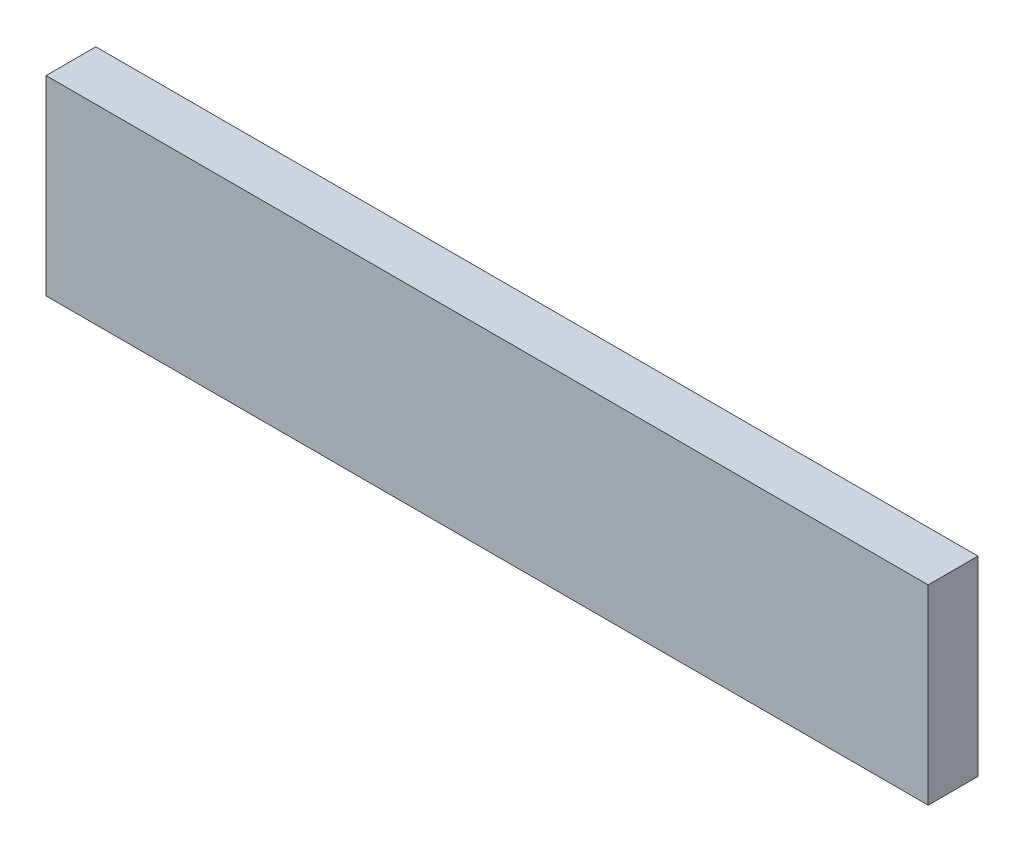
ISO-10303-21;
HEADER;
FILE_DESCRIPTION(('STEP AP214'),'2;1');
FILE_NAME('part.step','',(''),(''),'','','');
FILE_SCHEMA(('AUTOMOTIVE_DESIGN { 1 0 10303 214 1 1 1 1 }'));
ENDSEC;
DATA;
#1=APPLICATION_CONTEXT('core data for automotive mechanical design processes');
#2=APPLICATION_PROTOCOL_DEFINITION('international standard','automotive_design',2000,#1);
#3=PRODUCT_CONTEXT('',#1,'mechanical');
#4=PRODUCT('Part','Part','',(#3));
#5=PRODUCT_RELATED_PRODUCT_CATEGORY('part','',(#4));
#6=PRODUCT_DEFINITION_FORMATION('','',#4);
#7=PRODUCT_DEFINITION_CONTEXT('part definition',#1,'design');
#8=PRODUCT_DEFINITION('design','',#6,#7);
#9=PRODUCT_DEFINITION_SHAPE('','',#8);
#10=(LENGTH_UNIT() NAMED_UNIT(*) SI_UNIT(.MILLI.,.METRE.));
#11=(NAMED_UNIT(*) PLANE_ANGLE_UNIT() SI_UNIT($,.RADIAN.));
#12=(NAMED_UNIT(*) SI_UNIT($,.STERADIAN.) SOLID_ANGLE_UNIT());
#13=UNCERTAINTY_MEASURE_WITH_UNIT(LENGTH_MEASURE(1.E-05),#10,'distance_accuracy_value','');
#14=(GEOMETRIC_REPRESENTATION_CONTEXT(3) GLOBAL_UNCERTAINTY_ASSIGNED_CONTEXT((#13)) GLOBAL_UNIT_ASSIGNED_CONTEXT((#10,
#11,#12)) REPRESENTATION_CONTEXT('',''));
#15=CARTESIAN_POINT('',(0.,0.,0.));
#16=DIRECTION('',(0.,0.,1.));
#17=DIRECTION('',(1.,0.,0.));
#18=AXIS2_PLACEMENT_3D('',#15,#16,#17);
#19=CARTESIAN_POINT('',(0.,38.2926221353073,10.));
#20=DIRECTION('',(1.,0.,0.));
#21=DIRECTION('',(0.,0.,-1.));
#22=AXIS2_PLACEMENT_3D('',#19,#20,#21);
#23=PLANE('',#22);
#24=DIRECTION('',(0.,-1.,0.));
#25=VECTOR('',#24,1.);
#26=CARTESIAN_POINT('',(0.,38.2926221353073,0.));
#27=LINE('',#26,#25);
#28=CARTESIAN_POINT('',(0.,38.2926221353073,0.));
#29=VERTEX_POINT('',#28);
#30=CARTESIAN_POINT('',(0.,0.,0.));
#31=VERTEX_POINT('',#30);
#32=EDGE_CURVE('E113',#29,#31,#27,.T.);
#33=ORIENTED_EDGE('',*,*,#32,.T.);
#34=DIRECTION('',(0.,0.,-1.));
#35=VECTOR('',#34,1.);
#36=CARTESIAN_POINT('',(0.,0.,10.));
#37=LINE('',#36,#35);
#38=CARTESIAN_POINT('',(0.,0.,10.));
#39=VERTEX_POINT('',#38);
#40=EDGE_CURVE('E11',#39,#31,#37,.T.);
#41=ORIENTED_EDGE('',*,*,#40,.F.);
#42=DIRECTION('',(0.,-1.,0.));
#43=VECTOR('',#42,1.);
#44=CARTESIAN_POINT('',(0.,38.2926221353073,10.));
#45=LINE('',#44,#43);
#46=CARTESIAN_POINT('',(0.,38.2926221353073,10.));
#47=VERTEX_POINT('',#46);
#48=EDGE_CURVE('E97',#47,#39,#45,.T.);
#49=ORIENTED_EDGE('',*,*,#48,.F.);
#50=DIRECTION('',(0.,0.,-1.));
#51=VECTOR('',#50,1.);
#52=CARTESIAN_POINT('',(0.,38.2926221353073,10.));
#53=LINE('',#52,#51);
#54=EDGE_CURVE('E109',#47,#29,#53,.T.);
#55=ORIENTED_EDGE('',*,*,#54,.T.);
#56=EDGE_LOOP('',(#33,#41,#49,#55));
#57=FACE_BOUND('',#56,.T.);
#58=ADVANCED_FACE('F45',(#57),#23,.F.);
#59=CARTESIAN_POINT('',(0.,0.,10.));
#60=DIRECTION('',(0.,1.,0.));
#61=DIRECTION('',(0.,0.,1.));
#62=AXIS2_PLACEMENT_3D('',#59,#60,#61);
#63=PLANE('',#62);
#64=DIRECTION('',(1.,0.,0.));
#65=VECTOR('',#64,1.);
#66=CARTESIAN_POINT('',(0.,0.,0.));
#67=LINE('',#66,#65);
#68=CARTESIAN_POINT('',(177.039638226413,0.,0.));
#69=VERTEX_POINT('',#68);
#70=EDGE_CURVE('E102',#31,#69,#67,.T.);
#71=ORIENTED_EDGE('',*,*,#70,.T.);
#72=DIRECTION('',(0.,0.,-1.));
#73=VECTOR('',#72,1.);
#74=CARTESIAN_POINT('',(177.039638226413,0.,10.));
#75=LINE('',#74,#73);
#76=CARTESIAN_POINT('',(177.039638226413,0.,10.));
#77=VERTEX_POINT('',#76);
#78=EDGE_CURVE('E54',#77,#69,#75,.T.);
#79=ORIENTED_EDGE('',*,*,#78,.F.);
#80=DIRECTION('',(1.,0.,0.));
#81=VECTOR('',#80,1.);
#82=CARTESIAN_POINT('',(0.,0.,10.));
#83=LINE('',#82,#81);
#84=EDGE_CURVE('E92',#39,#77,#83,.T.);
#85=ORIENTED_EDGE('',*,*,#84,.F.);
#86=ORIENTED_EDGE('',*,*,#40,.T.);
#87=EDGE_LOOP('',(#71,#79,#85,#86));
#88=FACE_BOUND('',#87,.T.);
#89=ADVANCED_FACE('F101',(#88),#63,.F.);
#90=CARTESIAN_POINT('',(177.039638226413,0.,10.));
#91=DIRECTION('',(-1.,0.,0.));
#92=DIRECTION('',(0.,0.,1.));
#93=AXIS2_PLACEMENT_3D('',#90,#91,#92);
#94=PLANE('',#93);
#95=DIRECTION('',(0.,1.,0.));
#96=VECTOR('',#95,1.);
#97=CARTESIAN_POINT('',(177.039638226413,0.,0.));
#98=LINE('',#97,#96);
#99=CARTESIAN_POINT('',(177.039638226413,38.2926221353073,0.));
#100=VERTEX_POINT('',#99);
#101=EDGE_CURVE('E79',#69,#100,#98,.T.);
#102=ORIENTED_EDGE('',*,*,#101,.T.);
#103=DIRECTION('',(0.,0.,-1.));
#104=VECTOR('',#103,1.);
#105=CARTESIAN_POINT('',(177.039638226413,38.2926221353073,10.));
#106=LINE('',#105,#104);
#107=CARTESIAN_POINT('',(177.039638226413,38.2926221353073,10.));
#108=VERTEX_POINT('',#107);
#109=EDGE_CURVE('E104',#108,#100,#106,.T.);
#110=ORIENTED_EDGE('',*,*,#109,.F.);
#111=DIRECTION('',(0.,1.,0.));
#112=VECTOR('',#111,1.);
#113=CARTESIAN_POINT('',(177.039638226413,0.,10.));
#114=LINE('',#113,#112);
#115=EDGE_CURVE('E95',#77,#108,#114,.T.);
#116=ORIENTED_EDGE('',*,*,#115,.F.);
#117=ORIENTED_EDGE('',*,*,#78,.T.);
#118=EDGE_LOOP('',(#102,#110,#116,#117));
#119=FACE_BOUND('',#118,.T.);
#120=ADVANCED_FACE('F105',(#119),#94,.F.);
#121=CARTESIAN_POINT('',(177.039638226413,38.2926221353073,10.));
#122=DIRECTION('',(0.,-1.,0.));
#123=DIRECTION('',(0.,0.,-1.));
#124=AXIS2_PLACEMENT_3D('',#121,#122,#123);
#125=PLANE('',#124);
#126=DIRECTION('',(-1.,0.,0.));
#127=VECTOR('',#126,1.);
#128=CARTESIAN_POINT('',(177.039638226413,38.2926221353073,0.));
#129=LINE('',#128,#127);
#130=EDGE_CURVE('E85',#100,#29,#129,.T.);
#131=ORIENTED_EDGE('',*,*,#130,.T.);
#132=ORIENTED_EDGE('',*,*,#54,.F.);
#133=DIRECTION('',(-1.,0.,0.));
#134=VECTOR('',#133,1.);
#135=CARTESIAN_POINT('',(177.039638226413,38.2926221353073,10.));
#136=LINE('',#135,#134);
#137=EDGE_CURVE('E62',#108,#47,#136,.T.);
#138=ORIENTED_EDGE('',*,*,#137,.F.);
#139=ORIENTED_EDGE('',*,*,#109,.T.);
#140=EDGE_LOOP('',(#131,#132,#138,#139));
#141=FACE_BOUND('',#140,.T.);
#142=ADVANCED_FACE('F126',(#141),#125,.F.);
#143=CARTESIAN_POINT('',(0.,0.,10.));
#144=DIRECTION('',(0.,0.,1.));
#145=DIRECTION('',(1.,0.,0.));
#146=AXIS2_PLACEMENT_3D('',#143,#144,#145);
#147=PLANE('',#146);
#148=ORIENTED_EDGE('',*,*,#48,.T.);
#149=ORIENTED_EDGE('',*,*,#84,.T.);
#150=ORIENTED_EDGE('',*,*,#115,.T.);
#151=ORIENTED_EDGE('',*,*,#137,.T.);
#152=EDGE_LOOP('',(#148,#149,#150,#151));
#153=FACE_BOUND('',#152,.T.);
#154=ADVANCED_FACE('F93',(#153),#147,.T.);
#155=CARTESIAN_POINT('',(0.,0.,0.));
#156=DIRECTION('',(0.,0.,1.));
#157=DIRECTION('',(1.,0.,0.));
#158=AXIS2_PLACEMENT_3D('',#155,#156,#157);
#159=PLANE('',#158);
#160=ORIENTED_EDGE('',*,*,#32,.F.);
#161=ORIENTED_EDGE('',*,*,#130,.F.);
#162=ORIENTED_EDGE('',*,*,#101,.F.);
#163=ORIENTED_EDGE('',*,*,#70,.F.);
#164=EDGE_LOOP('',(#160,#161,#162,#163));
#165=FACE_BOUND('',#164,.T.);
#166=ADVANCED_FACE('F129',(#165),#159,.F.);
#167=CLOSED_SHELL('',(#58,#89,#120,#142,#154,#166));
#168=MANIFOLD_SOLID_BREP('B2',#167);
#169=ADVANCED_BREP_SHAPE_REPRESENTATION('',(#18,#168),#14);
#170=SHAPE_DEFINITION_REPRESENTATION(#9,#169);
ENDSEC;
END-ISO-10303-21;
